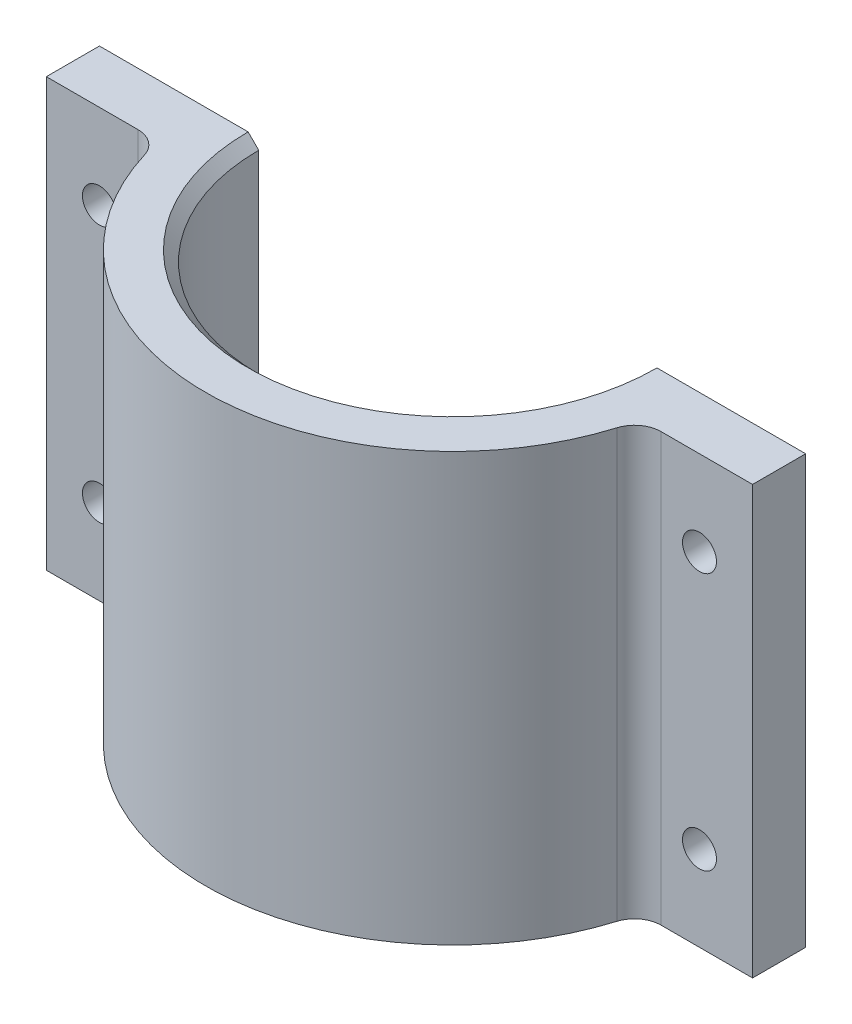
ISO-10303-21;
HEADER;
FILE_DESCRIPTION(('STEP AP214'),'2;1');
FILE_NAME('part.step','',(''),(''),'','','');
FILE_SCHEMA(('AUTOMOTIVE_DESIGN { 1 0 10303 214 1 1 1 1 }'));
ENDSEC;
DATA;
#1=APPLICATION_CONTEXT('core data for automotive mechanical design processes');
#2=APPLICATION_PROTOCOL_DEFINITION('international standard','automotive_design',2000,#1);
#3=PRODUCT_CONTEXT('',#1,'mechanical');
#4=PRODUCT('Part','Part','',(#3));
#5=PRODUCT_RELATED_PRODUCT_CATEGORY('part','',(#4));
#6=PRODUCT_DEFINITION_FORMATION('','',#4);
#7=PRODUCT_DEFINITION_CONTEXT('part definition',#1,'design');
#8=PRODUCT_DEFINITION('design','',#6,#7);
#9=PRODUCT_DEFINITION_SHAPE('','',#8);
#10=(LENGTH_UNIT() NAMED_UNIT(*) SI_UNIT(.MILLI.,.METRE.));
#11=(NAMED_UNIT(*) PLANE_ANGLE_UNIT() SI_UNIT($,.RADIAN.));
#12=(NAMED_UNIT(*) SI_UNIT($,.STERADIAN.) SOLID_ANGLE_UNIT());
#13=UNCERTAINTY_MEASURE_WITH_UNIT(LENGTH_MEASURE(1.E-05),#10,'distance_accuracy_value','');
#14=(GEOMETRIC_REPRESENTATION_CONTEXT(3) GLOBAL_UNCERTAINTY_ASSIGNED_CONTEXT((#13)) GLOBAL_UNIT_ASSIGNED_CONTEXT((#10,
#11,#12)) REPRESENTATION_CONTEXT('',''));
#15=CARTESIAN_POINT('',(0.,0.,0.));
#16=DIRECTION('',(0.,0.,1.));
#17=DIRECTION('',(1.,0.,0.));
#18=AXIS2_PLACEMENT_3D('',#15,#16,#17);
#19=CARTESIAN_POINT('',(0.,40.25,0.));
#20=DIRECTION('',(0.,-1.,0.));
#21=DIRECTION('',(0.,0.,-1.));
#22=AXIS2_PLACEMENT_3D('',#19,#20,#21);
#23=CYLINDRICAL_SURFACE('',#22,23.25);
#24=CARTESIAN_POINT('',(0.,0.,0.));
#25=DIRECTION('',(0.,1.,0.));
#26=DIRECTION('',(0.,0.,1.));
#27=AXIS2_PLACEMENT_3D('',#24,#25,#26);
#28=CIRCLE('',#27,23.25);
#29=CARTESIAN_POINT('',(-22.2419562965626,0.,6.77184466019418));
#30=VERTEX_POINT('',#29);
#31=CARTESIAN_POINT('',(22.2419562965626,0.,6.77184466019417));
#32=VERTEX_POINT('',#31);
#33=EDGE_CURVE('E181',#30,#32,#28,.T.);
#34=ORIENTED_EDGE('',*,*,#33,.T.);
#35=DIRECTION('',(0.,1.,0.));
#36=VECTOR('',#35,1.);
#37=CARTESIAN_POINT('',(22.2419562965626,-7.1817595269483,6.77184466019417));
#38=LINE('',#37,#36);
#39=CARTESIAN_POINT('',(22.2419562965626,40.25,6.77184466019417));
#40=VERTEX_POINT('',#39);
#41=EDGE_CURVE('E154',#32,#40,#38,.T.);
#42=ORIENTED_EDGE('',*,*,#41,.T.);
#43=CARTESIAN_POINT('',(0.,40.25,0.));
#44=DIRECTION('',(0.,1.,0.));
#45=DIRECTION('',(0.,0.,1.));
#46=AXIS2_PLACEMENT_3D('',#43,#44,#45);
#47=CIRCLE('',#46,23.25);
#48=CARTESIAN_POINT('',(-22.2419562965626,40.25,6.77184466019418));
#49=VERTEX_POINT('',#48);
#50=EDGE_CURVE('E190',#49,#40,#47,.T.);
#51=ORIENTED_EDGE('',*,*,#50,.F.);
#52=DIRECTION('',(0.,1.,0.));
#53=VECTOR('',#52,1.);
#54=CARTESIAN_POINT('',(-22.2419562965626,-7.1817595269483,6.77184466019418));
#55=LINE('',#54,#53);
#56=EDGE_CURVE('E182',#30,#49,#55,.T.);
#57=ORIENTED_EDGE('',*,*,#56,.F.);
#58=EDGE_LOOP('',(#34,#42,#51,#57));
#59=FACE_BOUND('',#58,.T.);
#60=ADVANCED_FACE('F37',(#59),#23,.T.);
#61=CARTESIAN_POINT('',(18.25,40.25,0.));
#62=DIRECTION('',(0.,0.,1.));
#63=DIRECTION('',(1.,0.,0.));
#64=AXIS2_PLACEMENT_3D('',#61,#62,#63);
#65=PLANE('',#64);
#66=CARTESIAN_POINT('',(28.25,7.99999999999999,0.));
#67=DIRECTION('',(0.,0.,-1.));
#68=DIRECTION('',(-1.,0.,0.));
#69=AXIS2_PLACEMENT_3D('',#66,#67,#68);
#70=CIRCLE('',#69,1.6);
#71=CARTESIAN_POINT('',(26.65,7.99999999999999,0.));
#72=VERTEX_POINT('',#71);
#73=EDGE_CURVE('E232',#72,#72,#70,.T.);
#74=ORIENTED_EDGE('',*,*,#73,.F.);
#75=EDGE_LOOP('',(#74));
#76=FACE_BOUND('',#75,.T.);
#77=CARTESIAN_POINT('',(28.25,32.25,0.));
#78=DIRECTION('',(0.,0.,-1.));
#79=DIRECTION('',(-1.,0.,0.));
#80=AXIS2_PLACEMENT_3D('',#77,#78,#79);
#81=CIRCLE('',#80,1.6);
#82=CARTESIAN_POINT('',(26.65,32.25,0.));
#83=VERTEX_POINT('',#82);
#84=EDGE_CURVE('E222',#83,#83,#81,.T.);
#85=ORIENTED_EDGE('',*,*,#84,.F.);
#86=EDGE_LOOP('',(#85));
#87=FACE_BOUND('',#86,.T.);
#88=DIRECTION('',(0.,-1.,0.));
#89=VECTOR('',#88,1.);
#90=CARTESIAN_POINT('',(18.25,40.25,0.));
#91=LINE('',#90,#89);
#92=CARTESIAN_POINT('',(18.25,39.25,0.));
#93=VERTEX_POINT('',#92);
#94=CARTESIAN_POINT('',(18.25,0.,0.));
#95=VERTEX_POINT('',#94);
#96=EDGE_CURVE('E207',#93,#95,#91,.T.);
#97=ORIENTED_EDGE('',*,*,#96,.F.);
#98=DIRECTION('',(0.707106781186545,0.70710678118655,0.));
#99=VECTOR('',#98,1.);
#100=CARTESIAN_POINT('',(0.,20.9999999999999,0.));
#101=LINE('',#100,#99);
#102=CARTESIAN_POINT('',(19.25,40.25,0.));
#103=VERTEX_POINT('',#102);
#104=EDGE_CURVE('E11',#93,#103,#101,.T.);
#105=ORIENTED_EDGE('',*,*,#104,.T.);
#106=DIRECTION('',(-1.,0.,0.));
#107=VECTOR('',#106,1.);
#108=CARTESIAN_POINT('',(18.25,40.25,0.));
#109=LINE('',#108,#107);
#110=CARTESIAN_POINT('',(33.25,40.25,0.));
#111=VERTEX_POINT('',#110);
#112=EDGE_CURVE('E192',#111,#103,#109,.T.);
#113=ORIENTED_EDGE('',*,*,#112,.F.);
#114=DIRECTION('',(0.,-1.,0.));
#115=VECTOR('',#114,1.);
#116=CARTESIAN_POINT('',(33.25,40.25,0.));
#117=LINE('',#116,#115);
#118=CARTESIAN_POINT('',(33.25,0.,0.));
#119=VERTEX_POINT('',#118);
#120=EDGE_CURVE('E133',#111,#119,#117,.T.);
#121=ORIENTED_EDGE('',*,*,#120,.T.);
#122=DIRECTION('',(-1.,0.,0.));
#123=VECTOR('',#122,1.);
#124=CARTESIAN_POINT('',(18.25,0.,0.));
#125=LINE('',#124,#123);
#126=EDGE_CURVE('E199',#119,#95,#125,.T.);
#127=ORIENTED_EDGE('',*,*,#126,.T.);
#128=EDGE_LOOP('',(#97,#105,#113,#121,#127));
#129=FACE_BOUND('',#128,.T.);
#130=ADVANCED_FACE('F268',(#76,#87,#129),#65,.F.);
#131=CARTESIAN_POINT('',(0.,40.25,0.));
#132=DIRECTION('',(0.,-1.,0.));
#133=DIRECTION('',(0.,0.,-1.));
#134=AXIS2_PLACEMENT_3D('',#131,#132,#133);
#135=CYLINDRICAL_SURFACE('',#134,18.25);
#136=DIRECTION('',(0.,-1.,0.));
#137=VECTOR('',#136,1.);
#138=CARTESIAN_POINT('',(-18.25,40.25,0.));
#139=LINE('',#138,#137);
#140=CARTESIAN_POINT('',(-18.25,39.25,0.));
#141=VERTEX_POINT('',#140);
#142=CARTESIAN_POINT('',(-18.25,0.,0.));
#143=VERTEX_POINT('',#142);
#144=EDGE_CURVE('E197',#141,#143,#139,.T.);
#145=ORIENTED_EDGE('',*,*,#144,.F.);
#146=CARTESIAN_POINT('',(0.,39.25,0.));
#147=DIRECTION('',(0.,1.,0.));
#148=DIRECTION('',(0.,0.,1.));
#149=AXIS2_PLACEMENT_3D('',#146,#147,#148);
#150=CIRCLE('',#149,18.25);
#151=EDGE_CURVE('E46',#141,#93,#150,.T.);
#152=ORIENTED_EDGE('',*,*,#151,.T.);
#153=ORIENTED_EDGE('',*,*,#96,.T.);
#154=CARTESIAN_POINT('',(0.,0.,0.));
#155=DIRECTION('',(0.,-1.,0.));
#156=DIRECTION('',(0.,0.,1.));
#157=AXIS2_PLACEMENT_3D('',#154,#155,#156);
#158=CIRCLE('',#157,18.25);
#159=EDGE_CURVE('E202',#95,#143,#158,.T.);
#160=ORIENTED_EDGE('',*,*,#159,.T.);
#161=EDGE_LOOP('',(#145,#152,#153,#160));
#162=FACE_BOUND('',#161,.T.);
#163=ADVANCED_FACE('F241',(#162),#135,.F.);
#164=CARTESIAN_POINT('',(-23.25,40.25,0.));
#165=DIRECTION('',(0.,0.,1.));
#166=DIRECTION('',(1.,0.,0.));
#167=AXIS2_PLACEMENT_3D('',#164,#165,#166);
#168=PLANE('',#167);
#169=CARTESIAN_POINT('',(-28.25,7.99999999999999,0.));
#170=DIRECTION('',(0.,0.,-1.));
#171=DIRECTION('',(-1.,0.,0.));
#172=AXIS2_PLACEMENT_3D('',#169,#170,#171);
#173=CIRCLE('',#172,1.6);
#174=CARTESIAN_POINT('',(-29.85,7.99999999999999,0.));
#175=VERTEX_POINT('',#174);
#176=EDGE_CURVE('E219',#175,#175,#173,.T.);
#177=ORIENTED_EDGE('',*,*,#176,.F.);
#178=EDGE_LOOP('',(#177));
#179=FACE_BOUND('',#178,.T.);
#180=CARTESIAN_POINT('',(-28.25,32.25,0.));
#181=DIRECTION('',(0.,0.,-1.));
#182=DIRECTION('',(-1.,0.,0.));
#183=AXIS2_PLACEMENT_3D('',#180,#181,#182);
#184=CIRCLE('',#183,1.6);
#185=CARTESIAN_POINT('',(-29.85,32.25,0.));
#186=VERTEX_POINT('',#185);
#187=EDGE_CURVE('E216',#186,#186,#184,.T.);
#188=ORIENTED_EDGE('',*,*,#187,.F.);
#189=EDGE_LOOP('',(#188));
#190=FACE_BOUND('',#189,.T.);
#191=DIRECTION('',(-1.,0.,0.));
#192=VECTOR('',#191,1.);
#193=CARTESIAN_POINT('',(-23.25,40.25,0.));
#194=LINE('',#193,#192);
#195=CARTESIAN_POINT('',(-19.25,40.25,0.));
#196=VERTEX_POINT('',#195);
#197=CARTESIAN_POINT('',(-33.25,40.25,0.));
#198=VERTEX_POINT('',#197);
#199=EDGE_CURVE('E195',#196,#198,#194,.T.);
#200=ORIENTED_EDGE('',*,*,#199,.F.);
#201=DIRECTION('',(0.707106781186545,-0.70710678118655,0.));
#202=VECTOR('',#201,1.);
#203=CARTESIAN_POINT('',(0.,20.9999999999999,0.));
#204=LINE('',#203,#202);
#205=EDGE_CURVE('E61',#196,#141,#204,.T.);
#206=ORIENTED_EDGE('',*,*,#205,.T.);
#207=ORIENTED_EDGE('',*,*,#144,.T.);
#208=DIRECTION('',(-1.,0.,0.));
#209=VECTOR('',#208,1.);
#210=CARTESIAN_POINT('',(-23.25,0.,0.));
#211=LINE('',#210,#209);
#212=CARTESIAN_POINT('',(-33.25,0.,0.));
#213=VERTEX_POINT('',#212);
#214=EDGE_CURVE('E193',#143,#213,#211,.T.);
#215=ORIENTED_EDGE('',*,*,#214,.T.);
#216=DIRECTION('',(0.,1.,0.));
#217=VECTOR('',#216,1.);
#218=CARTESIAN_POINT('',(-33.25,40.25,0.));
#219=LINE('',#218,#217);
#220=EDGE_CURVE('E161',#213,#198,#219,.T.);
#221=ORIENTED_EDGE('',*,*,#220,.T.);
#222=EDGE_LOOP('',(#200,#206,#207,#215,#221));
#223=FACE_BOUND('',#222,.T.);
#224=ADVANCED_FACE('F239',(#179,#190,#223),#168,.F.);
#225=CARTESIAN_POINT('',(0.,40.25,0.));
#226=DIRECTION('',(0.,1.,0.));
#227=DIRECTION('',(0.,0.,1.));
#228=AXIS2_PLACEMENT_3D('',#225,#226,#227);
#229=PLANE('',#228);
#230=ORIENTED_EDGE('',*,*,#112,.T.);
#231=CARTESIAN_POINT('',(0.,40.25,0.));
#232=DIRECTION('',(0.,1.,0.));
#233=DIRECTION('',(0.,0.,1.));
#234=AXIS2_PLACEMENT_3D('',#231,#232,#233);
#235=CIRCLE('',#234,19.25);
#236=EDGE_CURVE('E209',#103,#196,#235,.F.);
#237=ORIENTED_EDGE('',*,*,#236,.T.);
#238=ORIENTED_EDGE('',*,*,#199,.T.);
#239=DIRECTION('',(0.,0.,-1.));
#240=VECTOR('',#239,1.);
#241=CARTESIAN_POINT('',(-33.25,40.25,5.));
#242=LINE('',#241,#240);
#243=CARTESIAN_POINT('',(-33.25,40.25,5.));
#244=VERTEX_POINT('',#243);
#245=EDGE_CURVE('E173',#244,#198,#242,.T.);
#246=ORIENTED_EDGE('',*,*,#245,.F.);
#247=DIRECTION('',(1.,0.,0.));
#248=VECTOR('',#247,1.);
#249=CARTESIAN_POINT('',(-23.25,40.25,5.));
#250=LINE('',#249,#248);
#251=CARTESIAN_POINT('',(-24.633564500494,40.25,5.));
#252=VERTEX_POINT('',#251);
#253=EDGE_CURVE('E162',#244,#252,#250,.T.);
#254=ORIENTED_EDGE('',*,*,#253,.T.);
#255=CARTESIAN_POINT('',(-24.633564500494,40.25,7.5));
#256=DIRECTION('',(0.,-1.,0.));
#257=DIRECTION('',(0.,0.,1.));
#258=AXIS2_PLACEMENT_3D('',#255,#256,#257);
#259=CIRCLE('',#258,2.5);
#260=EDGE_CURVE('E176',#252,#49,#259,.T.);
#261=ORIENTED_EDGE('',*,*,#260,.T.);
#262=ORIENTED_EDGE('',*,*,#50,.T.);
#263=CARTESIAN_POINT('',(24.633564500494,40.25,7.5));
#264=DIRECTION('',(0.,-1.,0.));
#265=DIRECTION('',(0.,0.,1.));
#266=AXIS2_PLACEMENT_3D('',#263,#264,#265);
#267=CIRCLE('',#266,2.5);
#268=CARTESIAN_POINT('',(24.633564500494,40.25,5.));
#269=VERTEX_POINT('',#268);
#270=EDGE_CURVE('E128',#40,#269,#267,.T.);
#271=ORIENTED_EDGE('',*,*,#270,.T.);
#272=DIRECTION('',(1.,0.,0.));
#273=VECTOR('',#272,1.);
#274=CARTESIAN_POINT('',(23.25,40.25,5.));
#275=LINE('',#274,#273);
#276=CARTESIAN_POINT('',(33.25,40.25,5.));
#277=VERTEX_POINT('',#276);
#278=EDGE_CURVE('E120',#269,#277,#275,.T.);
#279=ORIENTED_EDGE('',*,*,#278,.T.);
#280=DIRECTION('',(0.,0.,-1.));
#281=VECTOR('',#280,1.);
#282=CARTESIAN_POINT('',(33.25,40.25,5.));
#283=LINE('',#282,#281);
#284=EDGE_CURVE('E124',#277,#111,#283,.T.);
#285=ORIENTED_EDGE('',*,*,#284,.T.);
#286=EDGE_LOOP('',(#230,#237,#238,#246,#254,#261,#262,#271,#279,#285));
#287=FACE_BOUND('',#286,.T.);
#288=ADVANCED_FACE('F123',(#287),#229,.T.);
#289=CARTESIAN_POINT('',(0.,0.,0.));
#290=DIRECTION('',(0.,1.,0.));
#291=DIRECTION('',(0.,0.,1.));
#292=AXIS2_PLACEMENT_3D('',#289,#290,#291);
#293=PLANE('',#292);
#294=ORIENTED_EDGE('',*,*,#33,.F.);
#295=CARTESIAN_POINT('',(-24.633564500494,0.,7.5));
#296=DIRECTION('',(0.,1.,0.));
#297=DIRECTION('',(0.,0.,1.));
#298=AXIS2_PLACEMENT_3D('',#295,#296,#297);
#299=CIRCLE('',#298,2.5);
#300=CARTESIAN_POINT('',(-24.633564500494,0.,5.));
#301=VERTEX_POINT('',#300);
#302=EDGE_CURVE('E179',#30,#301,#299,.T.);
#303=ORIENTED_EDGE('',*,*,#302,.T.);
#304=DIRECTION('',(-1.,0.,0.));
#305=VECTOR('',#304,1.);
#306=CARTESIAN_POINT('',(-23.25,0.,5.));
#307=LINE('',#306,#305);
#308=CARTESIAN_POINT('',(-33.25,0.,5.));
#309=VERTEX_POINT('',#308);
#310=EDGE_CURVE('E165',#301,#309,#307,.T.);
#311=ORIENTED_EDGE('',*,*,#310,.T.);
#312=DIRECTION('',(0.,0.,-1.));
#313=VECTOR('',#312,1.);
#314=CARTESIAN_POINT('',(-33.25,0.,5.));
#315=LINE('',#314,#313);
#316=EDGE_CURVE('E170',#309,#213,#315,.T.);
#317=ORIENTED_EDGE('',*,*,#316,.T.);
#318=ORIENTED_EDGE('',*,*,#214,.F.);
#319=ORIENTED_EDGE('',*,*,#159,.F.);
#320=ORIENTED_EDGE('',*,*,#126,.F.);
#321=DIRECTION('',(0.,0.,-1.));
#322=VECTOR('',#321,1.);
#323=CARTESIAN_POINT('',(33.25,0.,5.));
#324=LINE('',#323,#322);
#325=CARTESIAN_POINT('',(33.25,0.,5.));
#326=VERTEX_POINT('',#325);
#327=EDGE_CURVE('E140',#326,#119,#324,.T.);
#328=ORIENTED_EDGE('',*,*,#327,.F.);
#329=DIRECTION('',(-1.,0.,0.));
#330=VECTOR('',#329,1.);
#331=CARTESIAN_POINT('',(23.25,0.,5.));
#332=LINE('',#331,#330);
#333=CARTESIAN_POINT('',(24.633564500494,0.,5.));
#334=VERTEX_POINT('',#333);
#335=EDGE_CURVE('E141',#326,#334,#332,.T.);
#336=ORIENTED_EDGE('',*,*,#335,.T.);
#337=CARTESIAN_POINT('',(24.633564500494,0.,7.5));
#338=DIRECTION('',(0.,1.,0.));
#339=DIRECTION('',(0.,0.,1.));
#340=AXIS2_PLACEMENT_3D('',#337,#338,#339);
#341=CIRCLE('',#340,2.5);
#342=EDGE_CURVE('E157',#334,#32,#341,.T.);
#343=ORIENTED_EDGE('',*,*,#342,.T.);
#344=EDGE_LOOP('',(#294,#303,#311,#317,#318,#319,#320,#328,#336,#343));
#345=FACE_BOUND('',#344,.T.);
#346=ADVANCED_FACE('F265',(#345),#293,.F.);
#347=CARTESIAN_POINT('',(-24.633564500494,-7.1817595269483,7.5));
#348=DIRECTION('',(0.,1.,0.));
#349=DIRECTION('',(0.,0.,1.));
#350=AXIS2_PLACEMENT_3D('',#347,#348,#349);
#351=CYLINDRICAL_SURFACE('',#350,2.5);
#352=ORIENTED_EDGE('',*,*,#302,.F.);
#353=ORIENTED_EDGE('',*,*,#56,.T.);
#354=ORIENTED_EDGE('',*,*,#260,.F.);
#355=DIRECTION('',(0.,1.,0.));
#356=VECTOR('',#355,1.);
#357=CARTESIAN_POINT('',(-24.633564500494,-7.1817595269483,5.));
#358=LINE('',#357,#356);
#359=EDGE_CURVE('E185',#301,#252,#358,.T.);
#360=ORIENTED_EDGE('',*,*,#359,.F.);
#361=EDGE_LOOP('',(#352,#353,#354,#360));
#362=FACE_BOUND('',#361,.T.);
#363=ADVANCED_FACE('F257',(#362),#351,.F.);
#364=CARTESIAN_POINT('',(-33.25,40.25,5.));
#365=DIRECTION('',(-1.,0.,0.));
#366=DIRECTION('',(0.,-1.,0.));
#367=AXIS2_PLACEMENT_3D('',#364,#365,#366);
#368=PLANE('',#367);
#369=ORIENTED_EDGE('',*,*,#220,.F.);
#370=ORIENTED_EDGE('',*,*,#316,.F.);
#371=DIRECTION('',(0.,1.,0.));
#372=VECTOR('',#371,1.);
#373=CARTESIAN_POINT('',(-33.25,40.25,5.));
#374=LINE('',#373,#372);
#375=EDGE_CURVE('E167',#309,#244,#374,.T.);
#376=ORIENTED_EDGE('',*,*,#375,.T.);
#377=ORIENTED_EDGE('',*,*,#245,.T.);
#378=EDGE_LOOP('',(#369,#370,#376,#377));
#379=FACE_BOUND('',#378,.T.);
#380=ADVANCED_FACE('F248',(#379),#368,.T.);
#381=CARTESIAN_POINT('',(0.,0.,5.));
#382=DIRECTION('',(0.,0.,1.));
#383=DIRECTION('',(1.,0.,0.));
#384=AXIS2_PLACEMENT_3D('',#381,#382,#383);
#385=PLANE('',#384);
#386=CARTESIAN_POINT('',(-28.25,7.99999999999999,5.));
#387=DIRECTION('',(0.,0.,1.));
#388=DIRECTION('',(1.,0.,0.));
#389=AXIS2_PLACEMENT_3D('',#386,#387,#388);
#390=CIRCLE('',#389,1.6);
#391=CARTESIAN_POINT('',(-26.65,7.99999999999999,5.));
#392=VERTEX_POINT('',#391);
#393=EDGE_CURVE('E217',#392,#392,#390,.T.);
#394=ORIENTED_EDGE('',*,*,#393,.F.);
#395=EDGE_LOOP('',(#394));
#396=FACE_BOUND('',#395,.T.);
#397=CARTESIAN_POINT('',(-28.25,32.25,5.));
#398=DIRECTION('',(0.,0.,1.));
#399=DIRECTION('',(1.,0.,0.));
#400=AXIS2_PLACEMENT_3D('',#397,#398,#399);
#401=CIRCLE('',#400,1.6);
#402=CARTESIAN_POINT('',(-26.65,32.25,5.));
#403=VERTEX_POINT('',#402);
#404=EDGE_CURVE('E151',#403,#403,#401,.T.);
#405=ORIENTED_EDGE('',*,*,#404,.F.);
#406=EDGE_LOOP('',(#405));
#407=FACE_BOUND('',#406,.T.);
#408=ORIENTED_EDGE('',*,*,#310,.F.);
#409=ORIENTED_EDGE('',*,*,#359,.T.);
#410=ORIENTED_EDGE('',*,*,#253,.F.);
#411=ORIENTED_EDGE('',*,*,#375,.F.);
#412=EDGE_LOOP('',(#408,#409,#410,#411));
#413=FACE_BOUND('',#412,.T.);
#414=ADVANCED_FACE('F253',(#396,#407,#413),#385,.T.);
#415=CARTESIAN_POINT('',(24.633564500494,-7.1817595269483,7.5));
#416=DIRECTION('',(0.,1.,0.));
#417=DIRECTION('',(0.,0.,1.));
#418=AXIS2_PLACEMENT_3D('',#415,#416,#417);
#419=CYLINDRICAL_SURFACE('',#418,2.5);
#420=ORIENTED_EDGE('',*,*,#342,.F.);
#421=DIRECTION('',(0.,1.,0.));
#422=VECTOR('',#421,1.);
#423=CARTESIAN_POINT('',(24.633564500494,-7.1817595269483,5.));
#424=LINE('',#423,#422);
#425=EDGE_CURVE('E155',#334,#269,#424,.T.);
#426=ORIENTED_EDGE('',*,*,#425,.T.);
#427=ORIENTED_EDGE('',*,*,#270,.F.);
#428=ORIENTED_EDGE('',*,*,#41,.F.);
#429=EDGE_LOOP('',(#420,#426,#427,#428));
#430=FACE_BOUND('',#429,.T.);
#431=ADVANCED_FACE('F263',(#430),#419,.F.);
#432=CARTESIAN_POINT('',(33.25,40.25,5.));
#433=DIRECTION('',(1.,0.,0.));
#434=DIRECTION('',(0.,1.,0.));
#435=AXIS2_PLACEMENT_3D('',#432,#433,#434);
#436=PLANE('',#435);
#437=ORIENTED_EDGE('',*,*,#120,.F.);
#438=ORIENTED_EDGE('',*,*,#284,.F.);
#439=DIRECTION('',(0.,-1.,0.));
#440=VECTOR('',#439,1.);
#441=CARTESIAN_POINT('',(33.25,40.25,5.));
#442=LINE('',#441,#440);
#443=EDGE_CURVE('E132',#277,#326,#442,.T.);
#444=ORIENTED_EDGE('',*,*,#443,.T.);
#445=ORIENTED_EDGE('',*,*,#327,.T.);
#446=EDGE_LOOP('',(#437,#438,#444,#445));
#447=FACE_BOUND('',#446,.T.);
#448=ADVANCED_FACE('F137',(#447),#436,.T.);
#449=CARTESIAN_POINT('',(0.,0.,5.));
#450=DIRECTION('',(0.,0.,-1.));
#451=DIRECTION('',(-1.,0.,0.));
#452=AXIS2_PLACEMENT_3D('',#449,#450,#451);
#453=PLANE('',#452);
#454=CARTESIAN_POINT('',(28.25,7.99999999999999,5.));
#455=DIRECTION('',(0.,0.,-1.));
#456=DIRECTION('',(-1.,0.,0.));
#457=AXIS2_PLACEMENT_3D('',#454,#455,#456);
#458=CIRCLE('',#457,1.6);
#459=CARTESIAN_POINT('',(26.65,7.99999999999999,5.));
#460=VERTEX_POINT('',#459);
#461=EDGE_CURVE('E41',#460,#460,#458,.T.);
#462=ORIENTED_EDGE('',*,*,#461,.T.);
#463=EDGE_LOOP('',(#462));
#464=FACE_BOUND('',#463,.T.);
#465=CARTESIAN_POINT('',(28.25,32.25,5.));
#466=DIRECTION('',(0.,0.,-1.));
#467=DIRECTION('',(-1.,0.,0.));
#468=AXIS2_PLACEMENT_3D('',#465,#466,#467);
#469=CIRCLE('',#468,1.6);
#470=CARTESIAN_POINT('',(26.65,32.25,5.));
#471=VERTEX_POINT('',#470);
#472=EDGE_CURVE('E220',#471,#471,#469,.T.);
#473=ORIENTED_EDGE('',*,*,#472,.T.);
#474=EDGE_LOOP('',(#473));
#475=FACE_BOUND('',#474,.T.);
#476=ORIENTED_EDGE('',*,*,#425,.F.);
#477=ORIENTED_EDGE('',*,*,#335,.F.);
#478=ORIENTED_EDGE('',*,*,#443,.F.);
#479=ORIENTED_EDGE('',*,*,#278,.F.);
#480=EDGE_LOOP('',(#476,#477,#478,#479));
#481=FACE_BOUND('',#480,.T.);
#482=ADVANCED_FACE('F144',(#464,#475,#481),#453,.F.);
#483=CARTESIAN_POINT('',(0.,40.25,0.));
#484=DIRECTION('',(0.,1.,0.));
#485=DIRECTION('',(0.,0.,1.));
#486=AXIS2_PLACEMENT_3D('',#483,#484,#485);
#487=CONICAL_SURFACE('',#486,19.25,0.785398163397445);
#488=ORIENTED_EDGE('',*,*,#104,.F.);
#489=ORIENTED_EDGE('',*,*,#151,.F.);
#490=ORIENTED_EDGE('',*,*,#205,.F.);
#491=ORIENTED_EDGE('',*,*,#236,.F.);
#492=EDGE_LOOP('',(#488,#489,#490,#491));
#493=FACE_BOUND('',#492,.T.);
#494=ADVANCED_FACE('F39',(#493),#487,.F.);
#495=CARTESIAN_POINT('',(-28.25,32.25,23.25));
#496=DIRECTION('',(0.,0.,-1.));
#497=DIRECTION('',(-1.,0.,0.));
#498=AXIS2_PLACEMENT_3D('',#495,#496,#497);
#499=CYLINDRICAL_SURFACE('',#498,1.6);
#500=ORIENTED_EDGE('',*,*,#404,.T.);
#501=EDGE_LOOP('',(#500));
#502=FACE_BOUND('',#501,.T.);
#503=ORIENTED_EDGE('',*,*,#187,.T.);
#504=EDGE_LOOP('',(#503));
#505=FACE_BOUND('',#504,.T.);
#506=ADVANCED_FACE('F237',(#502,#505),#499,.F.);
#507=CARTESIAN_POINT('',(-28.25,7.99999999999999,23.25));
#508=DIRECTION('',(0.,0.,-1.));
#509=DIRECTION('',(-1.,0.,0.));
#510=AXIS2_PLACEMENT_3D('',#507,#508,#509);
#511=CYLINDRICAL_SURFACE('',#510,1.6);
#512=ORIENTED_EDGE('',*,*,#393,.T.);
#513=EDGE_LOOP('',(#512));
#514=FACE_BOUND('',#513,.T.);
#515=ORIENTED_EDGE('',*,*,#176,.T.);
#516=EDGE_LOOP('',(#515));
#517=FACE_BOUND('',#516,.T.);
#518=ADVANCED_FACE('F276',(#514,#517),#511,.F.);
#519=CARTESIAN_POINT('',(28.25,32.25,23.25));
#520=DIRECTION('',(0.,0.,-1.));
#521=DIRECTION('',(-1.,0.,0.));
#522=AXIS2_PLACEMENT_3D('',#519,#520,#521);
#523=CYLINDRICAL_SURFACE('',#522,1.6);
#524=ORIENTED_EDGE('',*,*,#84,.T.);
#525=EDGE_LOOP('',(#524));
#526=FACE_BOUND('',#525,.T.);
#527=ORIENTED_EDGE('',*,*,#472,.F.);
#528=EDGE_LOOP('',(#527));
#529=FACE_BOUND('',#528,.T.);
#530=ADVANCED_FACE('F309',(#526,#529),#523,.F.);
#531=CARTESIAN_POINT('',(28.25,7.99999999999999,23.25));
#532=DIRECTION('',(0.,0.,-1.));
#533=DIRECTION('',(-1.,0.,0.));
#534=AXIS2_PLACEMENT_3D('',#531,#532,#533);
#535=CYLINDRICAL_SURFACE('',#534,1.6);
#536=ORIENTED_EDGE('',*,*,#73,.T.);
#537=EDGE_LOOP('',(#536));
#538=FACE_BOUND('',#537,.T.);
#539=ORIENTED_EDGE('',*,*,#461,.F.);
#540=EDGE_LOOP('',(#539));
#541=FACE_BOUND('',#540,.T.);
#542=ADVANCED_FACE('F313',(#538,#541),#535,.F.);
#543=CLOSED_SHELL('',(#60,#130,#163,#224,#288,#346,#363,#380,#414,#431,#448,#482,#494,#506,#518,
#530,#542));
#544=MANIFOLD_SOLID_BREP('B2',#543);
#545=ADVANCED_BREP_SHAPE_REPRESENTATION('',(#18,#544),#14);
#546=SHAPE_DEFINITION_REPRESENTATION(#9,#545);
ENDSEC;
END-ISO-10303-21;
